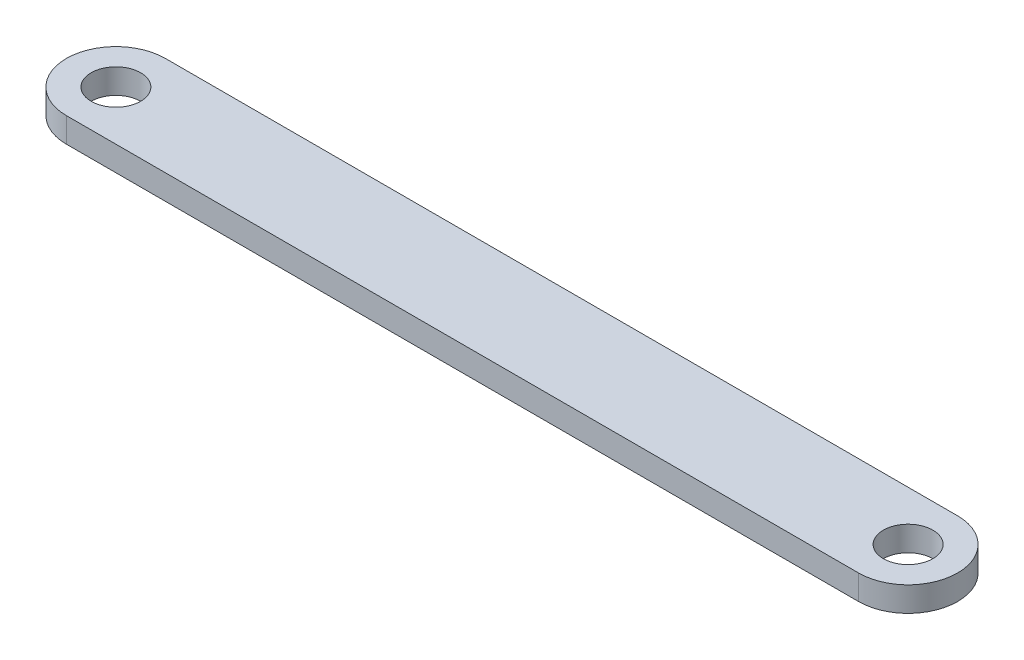
ISO-10303-21;
HEADER;
FILE_DESCRIPTION(('STEP AP214'),'2;1');
FILE_NAME('part.step','',(''),(''),'','','');
FILE_SCHEMA(('AUTOMOTIVE_DESIGN { 1 0 10303 214 1 1 1 1 }'));
ENDSEC;
DATA;
#1=APPLICATION_CONTEXT('core data for automotive mechanical design processes');
#2=APPLICATION_PROTOCOL_DEFINITION('international standard','automotive_design',2000,#1);
#3=PRODUCT_CONTEXT('',#1,'mechanical');
#4=PRODUCT('Part','Part','',(#3));
#5=PRODUCT_RELATED_PRODUCT_CATEGORY('part','',(#4));
#6=PRODUCT_DEFINITION_FORMATION('','',#4);
#7=PRODUCT_DEFINITION_CONTEXT('part definition',#1,'design');
#8=PRODUCT_DEFINITION('design','',#6,#7);
#9=PRODUCT_DEFINITION_SHAPE('','',#8);
#10=(LENGTH_UNIT() NAMED_UNIT(*) SI_UNIT(.MILLI.,.METRE.));
#11=(NAMED_UNIT(*) PLANE_ANGLE_UNIT() SI_UNIT($,.RADIAN.));
#12=(NAMED_UNIT(*) SI_UNIT($,.STERADIAN.) SOLID_ANGLE_UNIT());
#13=UNCERTAINTY_MEASURE_WITH_UNIT(LENGTH_MEASURE(1.E-05),#10,'distance_accuracy_value','');
#14=(GEOMETRIC_REPRESENTATION_CONTEXT(3) GLOBAL_UNCERTAINTY_ASSIGNED_CONTEXT((#13)) GLOBAL_UNIT_ASSIGNED_CONTEXT((#10,
#11,#12)) REPRESENTATION_CONTEXT('',''));
#15=CARTESIAN_POINT('',(0.,0.,0.));
#16=DIRECTION('',(0.,0.,1.));
#17=DIRECTION('',(1.,0.,0.));
#18=AXIS2_PLACEMENT_3D('',#15,#16,#17);
#19=CARTESIAN_POINT('',(-80.,5.,0.));
#20=DIRECTION('',(0.,1.,0.));
#21=DIRECTION('',(0.,0.,1.));
#22=AXIS2_PLACEMENT_3D('',#19,#20,#21);
#23=PLANE('',#22);
#24=CARTESIAN_POINT('',(-80.,5.,0.));
#25=DIRECTION('',(0.,1.,0.));
#26=DIRECTION('',(0.,0.,1.));
#27=AXIS2_PLACEMENT_3D('',#24,#25,#26);
#28=CIRCLE('',#27,5.);
#29=CARTESIAN_POINT('',(-80.,5.,5.));
#30=VERTEX_POINT('',#29);
#31=EDGE_CURVE('E112',#30,#30,#28,.T.);
#32=ORIENTED_EDGE('',*,*,#31,.F.);
#33=EDGE_LOOP('',(#32));
#34=FACE_BOUND('',#33,.T.);
#35=CARTESIAN_POINT('',(-80.,5.,0.));
#36=DIRECTION('',(0.,1.,0.));
#37=DIRECTION('',(0.,0.,1.));
#38=AXIS2_PLACEMENT_3D('',#35,#36,#37);
#39=CIRCLE('',#38,10.);
#40=CARTESIAN_POINT('',(-80.,5.,-10.));
#41=VERTEX_POINT('',#40);
#42=CARTESIAN_POINT('',(-80.,5.,10.));
#43=VERTEX_POINT('',#42);
#44=EDGE_CURVE('E92',#41,#43,#39,.T.);
#45=ORIENTED_EDGE('',*,*,#44,.T.);
#46=DIRECTION('',(1.,0.,0.));
#47=VECTOR('',#46,1.);
#48=CARTESIAN_POINT('',(-80.,5.,10.));
#49=LINE('',#48,#47);
#50=CARTESIAN_POINT('',(80.,5.,10.));
#51=VERTEX_POINT('',#50);
#52=EDGE_CURVE('E87',#43,#51,#49,.T.);
#53=ORIENTED_EDGE('',*,*,#52,.T.);
#54=CARTESIAN_POINT('',(80.,5.,0.));
#55=DIRECTION('',(0.,1.,0.));
#56=DIRECTION('',(0.,0.,1.));
#57=AXIS2_PLACEMENT_3D('',#54,#55,#56);
#58=CIRCLE('',#57,10.);
#59=CARTESIAN_POINT('',(80.,5.,-10.));
#60=VERTEX_POINT('',#59);
#61=EDGE_CURVE('E90',#51,#60,#58,.T.);
#62=ORIENTED_EDGE('',*,*,#61,.T.);
#63=DIRECTION('',(-1.,0.,0.));
#64=VECTOR('',#63,1.);
#65=CARTESIAN_POINT('',(-80.,5.,-10.));
#66=LINE('',#65,#64);
#67=EDGE_CURVE('E57',#60,#41,#66,.T.);
#68=ORIENTED_EDGE('',*,*,#67,.T.);
#69=EDGE_LOOP('',(#45,#53,#62,#68));
#70=FACE_BOUND('',#69,.T.);
#71=CARTESIAN_POINT('',(80.,5.,0.));
#72=DIRECTION('',(0.,1.,0.));
#73=DIRECTION('',(0.,0.,1.));
#74=AXIS2_PLACEMENT_3D('',#71,#72,#73);
#75=CIRCLE('',#74,5.);
#76=CARTESIAN_POINT('',(80.,5.,5.));
#77=VERTEX_POINT('',#76);
#78=EDGE_CURVE('E134',#77,#77,#75,.T.);
#79=ORIENTED_EDGE('',*,*,#78,.F.);
#80=EDGE_LOOP('',(#79));
#81=FACE_BOUND('',#80,.T.);
#82=ADVANCED_FACE('F39',(#34,#70,#81),#23,.T.);
#83=CARTESIAN_POINT('',(-80.,0.,0.));
#84=DIRECTION('',(0.,1.,0.));
#85=DIRECTION('',(0.,0.,1.));
#86=AXIS2_PLACEMENT_3D('',#83,#84,#85);
#87=PLANE('',#86);
#88=CARTESIAN_POINT('',(-80.,0.,0.));
#89=DIRECTION('',(0.,1.,0.));
#90=DIRECTION('',(0.,0.,1.));
#91=AXIS2_PLACEMENT_3D('',#88,#89,#90);
#92=CIRCLE('',#91,10.);
#93=CARTESIAN_POINT('',(-80.,0.,-10.));
#94=VERTEX_POINT('',#93);
#95=CARTESIAN_POINT('',(-80.,0.,10.));
#96=VERTEX_POINT('',#95);
#97=EDGE_CURVE('E108',#94,#96,#92,.T.);
#98=ORIENTED_EDGE('',*,*,#97,.F.);
#99=DIRECTION('',(-1.,0.,0.));
#100=VECTOR('',#99,1.);
#101=CARTESIAN_POINT('',(-80.,0.,-10.));
#102=LINE('',#101,#100);
#103=CARTESIAN_POINT('',(80.,0.,-10.));
#104=VERTEX_POINT('',#103);
#105=EDGE_CURVE('E80',#104,#94,#102,.T.);
#106=ORIENTED_EDGE('',*,*,#105,.F.);
#107=CARTESIAN_POINT('',(80.,0.,0.));
#108=DIRECTION('',(0.,1.,0.));
#109=DIRECTION('',(0.,0.,1.));
#110=AXIS2_PLACEMENT_3D('',#107,#108,#109);
#111=CIRCLE('',#110,10.);
#112=CARTESIAN_POINT('',(80.,0.,10.));
#113=VERTEX_POINT('',#112);
#114=EDGE_CURVE('E74',#113,#104,#111,.T.);
#115=ORIENTED_EDGE('',*,*,#114,.F.);
#116=DIRECTION('',(1.,0.,0.));
#117=VECTOR('',#116,1.);
#118=CARTESIAN_POINT('',(-80.,0.,10.));
#119=LINE('',#118,#117);
#120=EDGE_CURVE('E97',#96,#113,#119,.T.);
#121=ORIENTED_EDGE('',*,*,#120,.F.);
#122=EDGE_LOOP('',(#98,#106,#115,#121));
#123=FACE_BOUND('',#122,.T.);
#124=CARTESIAN_POINT('',(-80.,0.,0.));
#125=DIRECTION('',(0.,1.,0.));
#126=DIRECTION('',(0.,0.,1.));
#127=AXIS2_PLACEMENT_3D('',#124,#125,#126);
#128=CIRCLE('',#127,5.);
#129=CARTESIAN_POINT('',(-80.,0.,5.));
#130=VERTEX_POINT('',#129);
#131=EDGE_CURVE('E130',#130,#130,#128,.T.);
#132=ORIENTED_EDGE('',*,*,#131,.T.);
#133=EDGE_LOOP('',(#132));
#134=FACE_BOUND('',#133,.T.);
#135=CARTESIAN_POINT('',(80.,0.,0.));
#136=DIRECTION('',(0.,1.,0.));
#137=DIRECTION('',(0.,0.,1.));
#138=AXIS2_PLACEMENT_3D('',#135,#136,#137);
#139=CIRCLE('',#138,5.);
#140=CARTESIAN_POINT('',(80.,0.,5.));
#141=VERTEX_POINT('',#140);
#142=EDGE_CURVE('E138',#141,#141,#139,.T.);
#143=ORIENTED_EDGE('',*,*,#142,.T.);
#144=EDGE_LOOP('',(#143));
#145=FACE_BOUND('',#144,.T.);
#146=ADVANCED_FACE('F125',(#123,#134,#145),#87,.F.);
#147=CARTESIAN_POINT('',(-80.,5.,0.));
#148=DIRECTION('',(0.,-1.,0.));
#149=DIRECTION('',(0.,0.,-1.));
#150=AXIS2_PLACEMENT_3D('',#147,#148,#149);
#151=CYLINDRICAL_SURFACE('',#150,10.);
#152=ORIENTED_EDGE('',*,*,#97,.T.);
#153=DIRECTION('',(0.,-1.,0.));
#154=VECTOR('',#153,1.);
#155=CARTESIAN_POINT('',(-80.,5.,10.));
#156=LINE('',#155,#154);
#157=EDGE_CURVE('E11',#43,#96,#156,.T.);
#158=ORIENTED_EDGE('',*,*,#157,.F.);
#159=ORIENTED_EDGE('',*,*,#44,.F.);
#160=DIRECTION('',(0.,-1.,0.));
#161=VECTOR('',#160,1.);
#162=CARTESIAN_POINT('',(-80.,5.,-10.));
#163=LINE('',#162,#161);
#164=EDGE_CURVE('E104',#41,#94,#163,.T.);
#165=ORIENTED_EDGE('',*,*,#164,.T.);
#166=EDGE_LOOP('',(#152,#158,#159,#165));
#167=FACE_BOUND('',#166,.T.);
#168=ADVANCED_FACE('F41',(#167),#151,.T.);
#169=CARTESIAN_POINT('',(-80.,5.,10.));
#170=DIRECTION('',(0.,0.,-1.));
#171=DIRECTION('',(-1.,0.,0.));
#172=AXIS2_PLACEMENT_3D('',#169,#170,#171);
#173=PLANE('',#172);
#174=ORIENTED_EDGE('',*,*,#120,.T.);
#175=DIRECTION('',(0.,-1.,0.));
#176=VECTOR('',#175,1.);
#177=CARTESIAN_POINT('',(80.,5.,10.));
#178=LINE('',#177,#176);
#179=EDGE_CURVE('E49',#51,#113,#178,.T.);
#180=ORIENTED_EDGE('',*,*,#179,.F.);
#181=ORIENTED_EDGE('',*,*,#52,.F.);
#182=ORIENTED_EDGE('',*,*,#157,.T.);
#183=EDGE_LOOP('',(#174,#180,#181,#182));
#184=FACE_BOUND('',#183,.T.);
#185=ADVANCED_FACE('F96',(#184),#173,.F.);
#186=CARTESIAN_POINT('',(80.,5.,0.));
#187=DIRECTION('',(0.,-1.,0.));
#188=DIRECTION('',(0.,0.,-1.));
#189=AXIS2_PLACEMENT_3D('',#186,#187,#188);
#190=CYLINDRICAL_SURFACE('',#189,10.);
#191=ORIENTED_EDGE('',*,*,#114,.T.);
#192=DIRECTION('',(0.,-1.,0.));
#193=VECTOR('',#192,1.);
#194=CARTESIAN_POINT('',(80.,5.,-10.));
#195=LINE('',#194,#193);
#196=EDGE_CURVE('E99',#60,#104,#195,.T.);
#197=ORIENTED_EDGE('',*,*,#196,.F.);
#198=ORIENTED_EDGE('',*,*,#61,.F.);
#199=ORIENTED_EDGE('',*,*,#179,.T.);
#200=EDGE_LOOP('',(#191,#197,#198,#199));
#201=FACE_BOUND('',#200,.T.);
#202=ADVANCED_FACE('F100',(#201),#190,.T.);
#203=CARTESIAN_POINT('',(-80.,5.,-10.));
#204=DIRECTION('',(0.,0.,1.));
#205=DIRECTION('',(1.,0.,0.));
#206=AXIS2_PLACEMENT_3D('',#203,#204,#205);
#207=PLANE('',#206);
#208=ORIENTED_EDGE('',*,*,#105,.T.);
#209=ORIENTED_EDGE('',*,*,#164,.F.);
#210=ORIENTED_EDGE('',*,*,#67,.F.);
#211=ORIENTED_EDGE('',*,*,#196,.T.);
#212=EDGE_LOOP('',(#208,#209,#210,#211));
#213=FACE_BOUND('',#212,.T.);
#214=ADVANCED_FACE('F122',(#213),#207,.F.);
#215=CARTESIAN_POINT('',(-80.,5.,0.));
#216=DIRECTION('',(0.,-1.,0.));
#217=DIRECTION('',(0.,0.,-1.));
#218=AXIS2_PLACEMENT_3D('',#215,#216,#217);
#219=CYLINDRICAL_SURFACE('',#218,5.);
#220=ORIENTED_EDGE('',*,*,#31,.T.);
#221=EDGE_LOOP('',(#220));
#222=FACE_BOUND('',#221,.T.);
#223=ORIENTED_EDGE('',*,*,#131,.F.);
#224=EDGE_LOOP('',(#223));
#225=FACE_BOUND('',#224,.T.);
#226=ADVANCED_FACE('F157',(#222,#225),#219,.F.);
#227=CARTESIAN_POINT('',(80.,5.,0.));
#228=DIRECTION('',(0.,-1.,0.));
#229=DIRECTION('',(0.,0.,-1.));
#230=AXIS2_PLACEMENT_3D('',#227,#228,#229);
#231=CYLINDRICAL_SURFACE('',#230,5.);
#232=ORIENTED_EDGE('',*,*,#78,.T.);
#233=EDGE_LOOP('',(#232));
#234=FACE_BOUND('',#233,.T.);
#235=ORIENTED_EDGE('',*,*,#142,.F.);
#236=EDGE_LOOP('',(#235));
#237=FACE_BOUND('',#236,.T.);
#238=ADVANCED_FACE('F146',(#234,#237),#231,.F.);
#239=CLOSED_SHELL('',(#82,#146,#168,#185,#202,#214,#226,#238));
#240=MANIFOLD_SOLID_BREP('B2',#239);
#241=ADVANCED_BREP_SHAPE_REPRESENTATION('',(#18,#240),#14);
#242=SHAPE_DEFINITION_REPRESENTATION(#9,#241);
ENDSEC;
END-ISO-10303-21;
